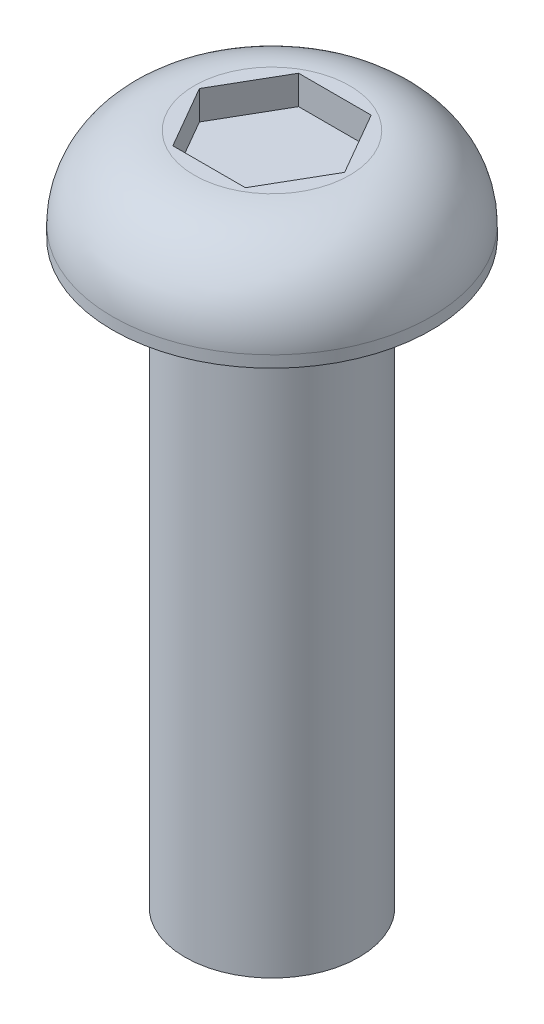
ISO-10303-21;
HEADER;
FILE_DESCRIPTION(('STEP AP214'),'2;1');
FILE_NAME('part.step','',(''),(''),'','','');
FILE_SCHEMA(('AUTOMOTIVE_DESIGN { 1 0 10303 214 1 1 1 1 }'));
ENDSEC;
DATA;
#1=APPLICATION_CONTEXT('core data for automotive mechanical design processes');
#2=APPLICATION_PROTOCOL_DEFINITION('international standard','automotive_design',2000,#1);
#3=PRODUCT_CONTEXT('',#1,'mechanical');
#4=PRODUCT('Part','Part','',(#3));
#5=PRODUCT_RELATED_PRODUCT_CATEGORY('part','',(#4));
#6=PRODUCT_DEFINITION_FORMATION('','',#4);
#7=PRODUCT_DEFINITION_CONTEXT('part definition',#1,'design');
#8=PRODUCT_DEFINITION('design','',#6,#7);
#9=PRODUCT_DEFINITION_SHAPE('','',#8);
#10=(LENGTH_UNIT() NAMED_UNIT(*) SI_UNIT(.MILLI.,.METRE.));
#11=(NAMED_UNIT(*) PLANE_ANGLE_UNIT() SI_UNIT($,.RADIAN.));
#12=(NAMED_UNIT(*) SI_UNIT($,.STERADIAN.) SOLID_ANGLE_UNIT());
#13=UNCERTAINTY_MEASURE_WITH_UNIT(LENGTH_MEASURE(1.E-05),#10,'distance_accuracy_value','');
#14=(GEOMETRIC_REPRESENTATION_CONTEXT(3) GLOBAL_UNCERTAINTY_ASSIGNED_CONTEXT((#13)) GLOBAL_UNIT_ASSIGNED_CONTEXT((#10,
#11,#12)) REPRESENTATION_CONTEXT('',''));
#15=CARTESIAN_POINT('',(0.,0.,0.));
#16=DIRECTION('',(0.,0.,1.));
#17=DIRECTION('',(1.,0.,0.));
#18=AXIS2_PLACEMENT_3D('',#15,#16,#17);
#19=CARTESIAN_POINT('',(0.,1.61,0.));
#20=DIRECTION('',(0.,-1.,0.));
#21=DIRECTION('',(0.,0.,-1.));
#22=AXIS2_PLACEMENT_3D('',#19,#20,#21);
#23=PLANE('',#22);
#24=DIRECTION('',(-1.,0.,0.));
#25=VECTOR('',#24,1.);
#26=CARTESIAN_POINT('',(0.626542480252685,1.61,-1.08520340889787));
#27=LINE('',#26,#25);
#28=CARTESIAN_POINT('',(0.626542480252685,1.61,-1.08520340889787));
#29=VERTEX_POINT('',#28);
#30=CARTESIAN_POINT('',(-0.626542480252684,1.61,-1.08520340889787));
#31=VERTEX_POINT('',#30);
#32=EDGE_CURVE('E121',#29,#31,#27,.T.);
#33=ORIENTED_EDGE('',*,*,#32,.F.);
#34=DIRECTION('',(-0.5,0.,-0.866025403784439));
#35=VECTOR('',#34,1.);
#36=CARTESIAN_POINT('',(1.25308496050537,1.61,0.));
#37=LINE('',#36,#35);
#38=CARTESIAN_POINT('',(1.25308496050537,1.61,0.));
#39=VERTEX_POINT('',#38);
#40=EDGE_CURVE('E47',#39,#29,#37,.T.);
#41=ORIENTED_EDGE('',*,*,#40,.F.);
#42=DIRECTION('',(0.5,0.,-0.866025403784439));
#43=VECTOR('',#42,1.);
#44=CARTESIAN_POINT('',(0.626542480252685,1.61,1.08520340889787));
#45=LINE('',#44,#43);
#46=CARTESIAN_POINT('',(0.626542480252685,1.61,1.08520340889787));
#47=VERTEX_POINT('',#46);
#48=EDGE_CURVE('E130',#47,#39,#45,.T.);
#49=ORIENTED_EDGE('',*,*,#48,.F.);
#50=DIRECTION('',(1.,0.,0.));
#51=VECTOR('',#50,1.);
#52=CARTESIAN_POINT('',(-0.626542480252684,1.61,1.08520340889787));
#53=LINE('',#52,#51);
#54=CARTESIAN_POINT('',(-0.626542480252684,1.61,1.08520340889787));
#55=VERTEX_POINT('',#54);
#56=EDGE_CURVE('E128',#55,#47,#53,.T.);
#57=ORIENTED_EDGE('',*,*,#56,.F.);
#58=DIRECTION('',(0.5,0.,0.866025403784439));
#59=VECTOR('',#58,1.);
#60=CARTESIAN_POINT('',(-1.25308496050537,1.61,0.));
#61=LINE('',#60,#59);
#62=CARTESIAN_POINT('',(-1.25308496050537,1.61,0.));
#63=VERTEX_POINT('',#62);
#64=EDGE_CURVE('E95',#63,#55,#61,.T.);
#65=ORIENTED_EDGE('',*,*,#64,.F.);
#66=DIRECTION('',(-0.5,0.,0.866025403784439));
#67=VECTOR('',#66,1.);
#68=CARTESIAN_POINT('',(-0.626542480252684,1.61,-1.08520340889787));
#69=LINE('',#68,#67);
#70=EDGE_CURVE('E124',#31,#63,#69,.T.);
#71=ORIENTED_EDGE('',*,*,#70,.F.);
#72=EDGE_LOOP('',(#33,#41,#49,#57,#65,#71));
#73=FACE_BOUND('',#72,.T.);
#74=CARTESIAN_POINT('',(0.,1.61,0.));
#75=DIRECTION('',(0.,1.,0.));
#76=DIRECTION('',(0.,0.,1.));
#77=AXIS2_PLACEMENT_3D('',#74,#75,#76);
#78=CIRCLE('',#77,1.34);
#79=CARTESIAN_POINT('',(0.,1.61,1.34));
#80=VERTEX_POINT('',#79);
#81=EDGE_CURVE('E11',#80,#80,#78,.T.);
#82=ORIENTED_EDGE('',*,*,#81,.T.);
#83=EDGE_LOOP('',(#82));
#84=FACE_BOUND('',#83,.T.);
#85=ADVANCED_FACE('F33',(#73,#84),#23,.F.);
#86=CARTESIAN_POINT('',(0.,0.2,0.));
#87=DIRECTION('',(0.,1.,0.));
#88=DIRECTION('',(0.,0.,1.));
#89=AXIS2_PLACEMENT_3D('',#86,#87,#88);
#90=DEGENERATE_TOROIDAL_SURFACE('',#89,1.34,1.41,.T.);
#91=ORIENTED_EDGE('',*,*,#81,.F.);
#92=EDGE_LOOP('',(#91));
#93=FACE_BOUND('',#92,.T.);
#94=CARTESIAN_POINT('',(0.,0.200000000000001,0.));
#95=DIRECTION('',(0.,1.,0.));
#96=DIRECTION('',(0.,0.,1.));
#97=AXIS2_PLACEMENT_3D('',#94,#95,#96);
#98=CIRCLE('',#97,2.75);
#99=CARTESIAN_POINT('',(0.,0.200000000000001,2.75));
#100=VERTEX_POINT('',#99);
#101=EDGE_CURVE('E40',#100,#100,#98,.T.);
#102=ORIENTED_EDGE('',*,*,#101,.T.);
#103=EDGE_LOOP('',(#102));
#104=FACE_BOUND('',#103,.T.);
#105=ADVANCED_FACE('F150',(#93,#104),#90,.T.);
#106=CARTESIAN_POINT('',(0.,9.0837699693481,0.));
#107=DIRECTION('',(0.,1.,0.));
#108=DIRECTION('',(0.,0.,1.));
#109=AXIS2_PLACEMENT_3D('',#106,#107,#108);
#110=CYLINDRICAL_SURFACE('',#109,2.75);
#111=ORIENTED_EDGE('',*,*,#101,.F.);
#112=EDGE_LOOP('',(#111));
#113=FACE_BOUND('',#112,.T.);
#114=CARTESIAN_POINT('',(0.,0.,0.));
#115=DIRECTION('',(0.,1.,0.));
#116=DIRECTION('',(0.,0.,1.));
#117=AXIS2_PLACEMENT_3D('',#114,#115,#116);
#118=CIRCLE('',#117,2.75);
#119=CARTESIAN_POINT('',(0.,0.,2.75));
#120=VERTEX_POINT('',#119);
#121=EDGE_CURVE('E145',#120,#120,#118,.T.);
#122=ORIENTED_EDGE('',*,*,#121,.T.);
#123=EDGE_LOOP('',(#122));
#124=FACE_BOUND('',#123,.T.);
#125=ADVANCED_FACE('F152',(#113,#124),#110,.T.);
#126=CARTESIAN_POINT('',(2.75,0.,0.));
#127=DIRECTION('',(0.,1.,0.));
#128=DIRECTION('',(0.,0.,1.));
#129=AXIS2_PLACEMENT_3D('',#126,#127,#128);
#130=PLANE('',#129);
#131=ORIENTED_EDGE('',*,*,#121,.F.);
#132=EDGE_LOOP('',(#131));
#133=FACE_BOUND('',#132,.T.);
#134=CARTESIAN_POINT('',(0.,0.,0.));
#135=DIRECTION('',(0.,1.,0.));
#136=DIRECTION('',(0.,0.,1.));
#137=AXIS2_PLACEMENT_3D('',#134,#135,#136);
#138=CIRCLE('',#137,1.5);
#139=CARTESIAN_POINT('',(0.,0.,1.5));
#140=VERTEX_POINT('',#139);
#141=EDGE_CURVE('E142',#140,#140,#138,.T.);
#142=ORIENTED_EDGE('',*,*,#141,.T.);
#143=EDGE_LOOP('',(#142));
#144=FACE_BOUND('',#143,.T.);
#145=ADVANCED_FACE('F155',(#133,#144),#130,.F.);
#146=CARTESIAN_POINT('',(0.,9.0837699693481,0.));
#147=DIRECTION('',(0.,1.,0.));
#148=DIRECTION('',(0.,0.,1.));
#149=AXIS2_PLACEMENT_3D('',#146,#147,#148);
#150=CYLINDRICAL_SURFACE('',#149,1.5);
#151=ORIENTED_EDGE('',*,*,#141,.F.);
#152=EDGE_LOOP('',(#151));
#153=FACE_BOUND('',#152,.T.);
#154=CARTESIAN_POINT('',(0.,-10.,0.));
#155=DIRECTION('',(0.,1.,0.));
#156=DIRECTION('',(0.,0.,1.));
#157=AXIS2_PLACEMENT_3D('',#154,#155,#156);
#158=CIRCLE('',#157,1.5);
#159=CARTESIAN_POINT('',(0.,-10.,1.5));
#160=VERTEX_POINT('',#159);
#161=EDGE_CURVE('E134',#160,#160,#158,.T.);
#162=ORIENTED_EDGE('',*,*,#161,.T.);
#163=EDGE_LOOP('',(#162));
#164=FACE_BOUND('',#163,.T.);
#165=ADVANCED_FACE('F161',(#153,#164),#150,.T.);
#166=CARTESIAN_POINT('',(1.5,-10.,0.));
#167=DIRECTION('',(0.,1.,0.));
#168=DIRECTION('',(0.,0.,1.));
#169=AXIS2_PLACEMENT_3D('',#166,#167,#168);
#170=PLANE('',#169);
#171=ORIENTED_EDGE('',*,*,#161,.F.);
#172=EDGE_LOOP('',(#171));
#173=FACE_BOUND('',#172,.T.);
#174=ADVANCED_FACE('F167',(#173),#170,.F.);
#175=CARTESIAN_POINT('',(1.25308496050537,1.11,0.));
#176=DIRECTION('',(0.866025403784439,0.,-0.5));
#177=DIRECTION('',(-0.5,0.,-0.866025403784439));
#178=AXIS2_PLACEMENT_3D('',#175,#176,#177);
#179=PLANE('',#178);
#180=ORIENTED_EDGE('',*,*,#40,.T.);
#181=DIRECTION('',(0.,1.,0.));
#182=VECTOR('',#181,1.);
#183=CARTESIAN_POINT('',(0.626542480252685,1.11,-1.08520340889787));
#184=LINE('',#183,#182);
#185=CARTESIAN_POINT('',(0.626542480252685,1.11,-1.08520340889787));
#186=VERTEX_POINT('',#185);
#187=EDGE_CURVE('E77',#186,#29,#184,.T.);
#188=ORIENTED_EDGE('',*,*,#187,.F.);
#189=DIRECTION('',(-0.5,0.,-0.866025403784439));
#190=VECTOR('',#189,1.);
#191=CARTESIAN_POINT('',(1.25308496050537,1.11,0.));
#192=LINE('',#191,#190);
#193=CARTESIAN_POINT('',(1.25308496050537,1.11,0.));
#194=VERTEX_POINT('',#193);
#195=EDGE_CURVE('E132',#194,#186,#192,.T.);
#196=ORIENTED_EDGE('',*,*,#195,.F.);
#197=DIRECTION('',(0.,1.,0.));
#198=VECTOR('',#197,1.);
#199=CARTESIAN_POINT('',(1.25308496050537,1.11,0.));
#200=LINE('',#199,#198);
#201=EDGE_CURVE('E55',#194,#39,#200,.T.);
#202=ORIENTED_EDGE('',*,*,#201,.T.);
#203=EDGE_LOOP('',(#180,#188,#196,#202));
#204=FACE_BOUND('',#203,.T.);
#205=ADVANCED_FACE('F172',(#204),#179,.F.);
#206=CARTESIAN_POINT('',(0.626542480252685,1.11,1.08520340889787));
#207=DIRECTION('',(0.866025403784439,0.,0.5));
#208=DIRECTION('',(0.5,0.,-0.866025403784439));
#209=AXIS2_PLACEMENT_3D('',#206,#207,#208);
#210=PLANE('',#209);
#211=ORIENTED_EDGE('',*,*,#48,.T.);
#212=ORIENTED_EDGE('',*,*,#201,.F.);
#213=DIRECTION('',(0.5,0.,-0.866025403784439));
#214=VECTOR('',#213,1.);
#215=CARTESIAN_POINT('',(0.626542480252685,1.11,1.08520340889787));
#216=LINE('',#215,#214);
#217=CARTESIAN_POINT('',(0.626542480252685,1.11,1.08520340889787));
#218=VERTEX_POINT('',#217);
#219=EDGE_CURVE('E107',#218,#194,#216,.T.);
#220=ORIENTED_EDGE('',*,*,#219,.F.);
#221=DIRECTION('',(0.,1.,0.));
#222=VECTOR('',#221,1.);
#223=CARTESIAN_POINT('',(0.626542480252685,1.11,1.08520340889787));
#224=LINE('',#223,#222);
#225=EDGE_CURVE('E99',#218,#47,#224,.T.);
#226=ORIENTED_EDGE('',*,*,#225,.T.);
#227=EDGE_LOOP('',(#211,#212,#220,#226));
#228=FACE_BOUND('',#227,.T.);
#229=ADVANCED_FACE('F177',(#228),#210,.F.);
#230=CARTESIAN_POINT('',(-0.626542480252684,1.11,1.08520340889787));
#231=DIRECTION('',(0.,0.,1.));
#232=DIRECTION('',(1.,0.,0.));
#233=AXIS2_PLACEMENT_3D('',#230,#231,#232);
#234=PLANE('',#233);
#235=ORIENTED_EDGE('',*,*,#56,.T.);
#236=ORIENTED_EDGE('',*,*,#225,.F.);
#237=DIRECTION('',(1.,0.,0.));
#238=VECTOR('',#237,1.);
#239=CARTESIAN_POINT('',(-0.626542480252684,1.11,1.08520340889787));
#240=LINE('',#239,#238);
#241=CARTESIAN_POINT('',(-0.626542480252684,1.11,1.08520340889787));
#242=VERTEX_POINT('',#241);
#243=EDGE_CURVE('E103',#242,#218,#240,.T.);
#244=ORIENTED_EDGE('',*,*,#243,.F.);
#245=DIRECTION('',(0.,1.,0.));
#246=VECTOR('',#245,1.);
#247=CARTESIAN_POINT('',(-0.626542480252684,1.11,1.08520340889787));
#248=LINE('',#247,#246);
#249=EDGE_CURVE('E88',#242,#55,#248,.T.);
#250=ORIENTED_EDGE('',*,*,#249,.T.);
#251=EDGE_LOOP('',(#235,#236,#244,#250));
#252=FACE_BOUND('',#251,.T.);
#253=ADVANCED_FACE('F104',(#252),#234,.F.);
#254=CARTESIAN_POINT('',(-1.25308496050537,1.11,0.));
#255=DIRECTION('',(-0.866025403784439,0.,0.5));
#256=DIRECTION('',(0.5,0.,0.866025403784439));
#257=AXIS2_PLACEMENT_3D('',#254,#255,#256);
#258=PLANE('',#257);
#259=ORIENTED_EDGE('',*,*,#64,.T.);
#260=ORIENTED_EDGE('',*,*,#249,.F.);
#261=DIRECTION('',(0.5,0.,0.866025403784439));
#262=VECTOR('',#261,1.);
#263=CARTESIAN_POINT('',(-1.25308496050537,1.11,0.));
#264=LINE('',#263,#262);
#265=CARTESIAN_POINT('',(-1.25308496050537,1.11,0.));
#266=VERTEX_POINT('',#265);
#267=EDGE_CURVE('E92',#266,#242,#264,.T.);
#268=ORIENTED_EDGE('',*,*,#267,.F.);
#269=DIRECTION('',(0.,1.,0.));
#270=VECTOR('',#269,1.);
#271=CARTESIAN_POINT('',(-1.25308496050537,1.11,0.));
#272=LINE('',#271,#270);
#273=EDGE_CURVE('E100',#266,#63,#272,.T.);
#274=ORIENTED_EDGE('',*,*,#273,.T.);
#275=EDGE_LOOP('',(#259,#260,#268,#274));
#276=FACE_BOUND('',#275,.T.);
#277=ADVANCED_FACE('F90',(#276),#258,.F.);
#278=CARTESIAN_POINT('',(-0.626542480252684,1.11,-1.08520340889787));
#279=DIRECTION('',(-0.866025403784439,0.,-0.5));
#280=DIRECTION('',(-0.5,0.,0.866025403784439));
#281=AXIS2_PLACEMENT_3D('',#278,#279,#280);
#282=PLANE('',#281);
#283=ORIENTED_EDGE('',*,*,#70,.T.);
#284=ORIENTED_EDGE('',*,*,#273,.F.);
#285=DIRECTION('',(-0.5,0.,0.866025403784439));
#286=VECTOR('',#285,1.);
#287=CARTESIAN_POINT('',(-0.626542480252684,1.11,-1.08520340889787));
#288=LINE('',#287,#286);
#289=CARTESIAN_POINT('',(-0.626542480252684,1.11,-1.08520340889787));
#290=VERTEX_POINT('',#289);
#291=EDGE_CURVE('E113',#290,#266,#288,.T.);
#292=ORIENTED_EDGE('',*,*,#291,.F.);
#293=DIRECTION('',(0.,1.,0.));
#294=VECTOR('',#293,1.);
#295=CARTESIAN_POINT('',(-0.626542480252684,1.11,-1.08520340889787));
#296=LINE('',#295,#294);
#297=EDGE_CURVE('E137',#290,#31,#296,.T.);
#298=ORIENTED_EDGE('',*,*,#297,.T.);
#299=EDGE_LOOP('',(#283,#284,#292,#298));
#300=FACE_BOUND('',#299,.T.);
#301=ADVANCED_FACE('F203',(#300),#282,.F.);
#302=CARTESIAN_POINT('',(0.626542480252685,1.11,-1.08520340889787));
#303=DIRECTION('',(0.,0.,-1.));
#304=DIRECTION('',(-1.,0.,0.));
#305=AXIS2_PLACEMENT_3D('',#302,#303,#304);
#306=PLANE('',#305);
#307=ORIENTED_EDGE('',*,*,#32,.T.);
#308=ORIENTED_EDGE('',*,*,#297,.F.);
#309=DIRECTION('',(-1.,0.,0.));
#310=VECTOR('',#309,1.);
#311=CARTESIAN_POINT('',(0.626542480252685,1.11,-1.08520340889787));
#312=LINE('',#311,#310);
#313=EDGE_CURVE('E115',#186,#290,#312,.T.);
#314=ORIENTED_EDGE('',*,*,#313,.F.);
#315=ORIENTED_EDGE('',*,*,#187,.T.);
#316=EDGE_LOOP('',(#307,#308,#314,#315));
#317=FACE_BOUND('',#316,.T.);
#318=ADVANCED_FACE('F191',(#317),#306,.F.);
#319=CARTESIAN_POINT('',(0.,1.11,0.));
#320=DIRECTION('',(0.,1.,0.));
#321=DIRECTION('',(0.,0.,1.));
#322=AXIS2_PLACEMENT_3D('',#319,#320,#321);
#323=PLANE('',#322);
#324=ORIENTED_EDGE('',*,*,#195,.T.);
#325=ORIENTED_EDGE('',*,*,#313,.T.);
#326=ORIENTED_EDGE('',*,*,#291,.T.);
#327=ORIENTED_EDGE('',*,*,#267,.T.);
#328=ORIENTED_EDGE('',*,*,#243,.T.);
#329=ORIENTED_EDGE('',*,*,#219,.T.);
#330=EDGE_LOOP('',(#324,#325,#326,#327,#328,#329));
#331=FACE_BOUND('',#330,.T.);
#332=ADVANCED_FACE('F110',(#331),#323,.T.);
#333=CLOSED_SHELL('',(#85,#105,#125,#145,#165,#174,#205,#229,#253,#277,#301,#318,#332));
#334=MANIFOLD_SOLID_BREP('B2',#333);
#335=ADVANCED_BREP_SHAPE_REPRESENTATION('',(#18,#334),#14);
#336=SHAPE_DEFINITION_REPRESENTATION(#9,#335);
ENDSEC;
END-ISO-10303-21;
